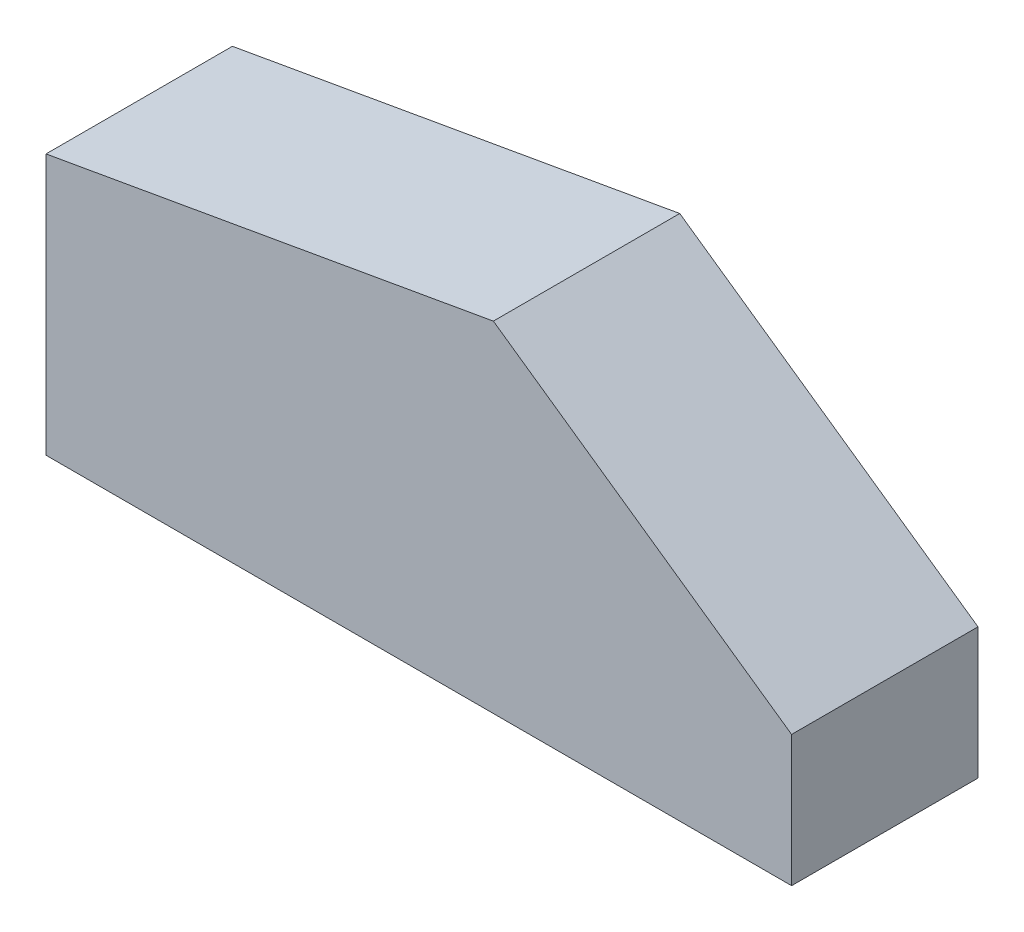
ISO-10303-21;
HEADER;
FILE_DESCRIPTION(('STEP AP214'),'2;1');
FILE_NAME('part.step','',(''),(''),'','','');
FILE_SCHEMA(('AUTOMOTIVE_DESIGN { 1 0 10303 214 1 1 1 1 }'));
ENDSEC;
DATA;
#1=APPLICATION_CONTEXT('core data for automotive mechanical design processes');
#2=APPLICATION_PROTOCOL_DEFINITION('international standard','automotive_design',2000,#1);
#3=PRODUCT_CONTEXT('',#1,'mechanical');
#4=PRODUCT('Part','Part','',(#3));
#5=PRODUCT_RELATED_PRODUCT_CATEGORY('part','',(#4));
#6=PRODUCT_DEFINITION_FORMATION('','',#4);
#7=PRODUCT_DEFINITION_CONTEXT('part definition',#1,'design');
#8=PRODUCT_DEFINITION('design','',#6,#7);
#9=PRODUCT_DEFINITION_SHAPE('','',#8);
#10=(LENGTH_UNIT() NAMED_UNIT(*) SI_UNIT(.MILLI.,.METRE.));
#11=(NAMED_UNIT(*) PLANE_ANGLE_UNIT() SI_UNIT($,.RADIAN.));
#12=(NAMED_UNIT(*) SI_UNIT($,.STERADIAN.) SOLID_ANGLE_UNIT());
#13=UNCERTAINTY_MEASURE_WITH_UNIT(LENGTH_MEASURE(1.E-05),#10,'distance_accuracy_value','');
#14=(GEOMETRIC_REPRESENTATION_CONTEXT(3) GLOBAL_UNCERTAINTY_ASSIGNED_CONTEXT((#13)) GLOBAL_UNIT_ASSIGNED_CONTEXT((#10,
#11,#12)) REPRESENTATION_CONTEXT('',''));
#15=CARTESIAN_POINT('',(0.,0.,0.));
#16=DIRECTION('',(0.,0.,1.));
#17=DIRECTION('',(1.,0.,0.));
#18=AXIS2_PLACEMENT_3D('',#15,#16,#17);
#19=CARTESIAN_POINT('',(0.,35.,25.));
#20=DIRECTION('',(1.,0.,0.));
#21=DIRECTION('',(0.,1.,0.));
#22=AXIS2_PLACEMENT_3D('',#19,#20,#21);
#23=PLANE('',#22);
#24=DIRECTION('',(0.,-1.,0.));
#25=VECTOR('',#24,1.);
#26=CARTESIAN_POINT('',(0.,35.,0.));
#27=LINE('',#26,#25);
#28=CARTESIAN_POINT('',(0.,35.,0.));
#29=VERTEX_POINT('',#28);
#30=CARTESIAN_POINT('',(0.,0.,0.));
#31=VERTEX_POINT('',#30);
#32=EDGE_CURVE('E107',#29,#31,#27,.T.);
#33=ORIENTED_EDGE('',*,*,#32,.T.);
#34=DIRECTION('',(0.,0.,-1.));
#35=VECTOR('',#34,1.);
#36=CARTESIAN_POINT('',(0.,0.,25.));
#37=LINE('',#36,#35);
#38=CARTESIAN_POINT('',(0.,0.,25.));
#39=VERTEX_POINT('',#38);
#40=EDGE_CURVE('E11',#39,#31,#37,.T.);
#41=ORIENTED_EDGE('',*,*,#40,.F.);
#42=DIRECTION('',(0.,-1.,0.));
#43=VECTOR('',#42,1.);
#44=CARTESIAN_POINT('',(0.,35.,25.));
#45=LINE('',#44,#43);
#46=CARTESIAN_POINT('',(0.,35.,25.));
#47=VERTEX_POINT('',#46);
#48=EDGE_CURVE('E115',#47,#39,#45,.T.);
#49=ORIENTED_EDGE('',*,*,#48,.F.);
#50=DIRECTION('',(0.,0.,-1.));
#51=VECTOR('',#50,1.);
#52=CARTESIAN_POINT('',(0.,35.,25.));
#53=LINE('',#52,#51);
#54=EDGE_CURVE('E103',#47,#29,#53,.T.);
#55=ORIENTED_EDGE('',*,*,#54,.T.);
#56=EDGE_LOOP('',(#33,#41,#49,#55));
#57=FACE_BOUND('',#56,.T.);
#58=ADVANCED_FACE('F33',(#57),#23,.F.);
#59=CARTESIAN_POINT('',(0.,0.,25.));
#60=DIRECTION('',(0.,1.,0.));
#61=DIRECTION('',(0.,0.,1.));
#62=AXIS2_PLACEMENT_3D('',#59,#60,#61);
#63=PLANE('',#62);
#64=DIRECTION('',(1.,0.,0.));
#65=VECTOR('',#64,1.);
#66=CARTESIAN_POINT('',(0.,0.,0.));
#67=LINE('',#66,#65);
#68=CARTESIAN_POINT('',(100.,0.,0.));
#69=VERTEX_POINT('',#68);
#70=EDGE_CURVE('E110',#31,#69,#67,.T.);
#71=ORIENTED_EDGE('',*,*,#70,.T.);
#72=DIRECTION('',(0.,0.,-1.));
#73=VECTOR('',#72,1.);
#74=CARTESIAN_POINT('',(100.,0.,25.));
#75=LINE('',#74,#73);
#76=CARTESIAN_POINT('',(100.,0.,25.));
#77=VERTEX_POINT('',#76);
#78=EDGE_CURVE('E41',#77,#69,#75,.T.);
#79=ORIENTED_EDGE('',*,*,#78,.F.);
#80=DIRECTION('',(1.,0.,0.));
#81=VECTOR('',#80,1.);
#82=CARTESIAN_POINT('',(0.,0.,25.));
#83=LINE('',#82,#81);
#84=EDGE_CURVE('E83',#39,#77,#83,.T.);
#85=ORIENTED_EDGE('',*,*,#84,.F.);
#86=ORIENTED_EDGE('',*,*,#40,.T.);
#87=EDGE_LOOP('',(#71,#79,#85,#86));
#88=FACE_BOUND('',#87,.T.);
#89=ADVANCED_FACE('F134',(#88),#63,.F.);
#90=CARTESIAN_POINT('',(100.,0.,25.));
#91=DIRECTION('',(-1.,0.,0.));
#92=DIRECTION('',(0.,0.,1.));
#93=AXIS2_PLACEMENT_3D('',#90,#91,#92);
#94=PLANE('',#93);
#95=DIRECTION('',(0.,1.,0.));
#96=VECTOR('',#95,1.);
#97=CARTESIAN_POINT('',(100.,0.,0.));
#98=LINE('',#97,#96);
#99=CARTESIAN_POINT('',(100.,17.571317314119,0.));
#100=VERTEX_POINT('',#99);
#101=EDGE_CURVE('E98',#69,#100,#98,.T.);
#102=ORIENTED_EDGE('',*,*,#101,.T.);
#103=DIRECTION('',(0.,0.,-1.));
#104=VECTOR('',#103,1.);
#105=CARTESIAN_POINT('',(100.,17.571317314119,25.));
#106=LINE('',#105,#104);
#107=CARTESIAN_POINT('',(100.,17.571317314119,25.));
#108=VERTEX_POINT('',#107);
#109=EDGE_CURVE('E95',#108,#100,#106,.T.);
#110=ORIENTED_EDGE('',*,*,#109,.F.);
#111=DIRECTION('',(0.,1.,0.));
#112=VECTOR('',#111,1.);
#113=CARTESIAN_POINT('',(100.,0.,25.));
#114=LINE('',#113,#112);
#115=EDGE_CURVE('E87',#77,#108,#114,.T.);
#116=ORIENTED_EDGE('',*,*,#115,.F.);
#117=ORIENTED_EDGE('',*,*,#78,.T.);
#118=EDGE_LOOP('',(#102,#110,#116,#117));
#119=FACE_BOUND('',#118,.T.);
#120=ADVANCED_FACE('F96',(#119),#94,.F.);
#121=CARTESIAN_POINT('',(100.,17.571317314119,25.));
#122=DIRECTION('',(-0.57357643635105,-0.819152044288989,0.));
#123=DIRECTION('',(0.819152044288989,-0.57357643635105,0.));
#124=AXIS2_PLACEMENT_3D('',#121,#122,#123);
#125=PLANE('',#124);
#126=DIRECTION('',(-0.819152044288989,0.57357643635105,0.));
#127=VECTOR('',#126,1.);
#128=CARTESIAN_POINT('',(100.,17.571317314119,0.));
#129=LINE('',#128,#127);
#130=CARTESIAN_POINT('',(60.,45.5796188425077,0.));
#131=VERTEX_POINT('',#130);
#132=EDGE_CURVE('E69',#100,#131,#129,.T.);
#133=ORIENTED_EDGE('',*,*,#132,.T.);
#134=DIRECTION('',(0.,0.,-1.));
#135=VECTOR('',#134,1.);
#136=CARTESIAN_POINT('',(60.,45.5796188425077,25.));
#137=LINE('',#136,#135);
#138=CARTESIAN_POINT('',(60.,45.5796188425077,25.));
#139=VERTEX_POINT('',#138);
#140=EDGE_CURVE('E99',#139,#131,#137,.T.);
#141=ORIENTED_EDGE('',*,*,#140,.F.);
#142=DIRECTION('',(-0.819152044288989,0.57357643635105,0.));
#143=VECTOR('',#142,1.);
#144=CARTESIAN_POINT('',(100.,17.571317314119,25.));
#145=LINE('',#144,#143);
#146=EDGE_CURVE('E91',#108,#139,#145,.T.);
#147=ORIENTED_EDGE('',*,*,#146,.F.);
#148=ORIENTED_EDGE('',*,*,#109,.T.);
#149=EDGE_LOOP('',(#133,#141,#147,#148));
#150=FACE_BOUND('',#149,.T.);
#151=ADVANCED_FACE('F101',(#150),#125,.F.);
#152=CARTESIAN_POINT('',(60.,45.5796188425077,25.));
#153=DIRECTION('',(0.173648177666927,-0.984807753012209,0.));
#154=DIRECTION('',(0.984807753012209,0.173648177666927,0.));
#155=AXIS2_PLACEMENT_3D('',#152,#153,#154);
#156=PLANE('',#155);
#157=DIRECTION('',(-0.984807753012209,-0.173648177666927,0.));
#158=VECTOR('',#157,1.);
#159=CARTESIAN_POINT('',(60.,45.5796188425077,0.));
#160=LINE('',#159,#158);
#161=EDGE_CURVE('E75',#131,#29,#160,.T.);
#162=ORIENTED_EDGE('',*,*,#161,.T.);
#163=ORIENTED_EDGE('',*,*,#54,.F.);
#164=DIRECTION('',(-0.984807753012209,-0.173648177666927,0.));
#165=VECTOR('',#164,1.);
#166=CARTESIAN_POINT('',(60.,45.5796188425077,25.));
#167=LINE('',#166,#165);
#168=EDGE_CURVE('E49',#139,#47,#167,.T.);
#169=ORIENTED_EDGE('',*,*,#168,.F.);
#170=ORIENTED_EDGE('',*,*,#140,.T.);
#171=EDGE_LOOP('',(#162,#163,#169,#170));
#172=FACE_BOUND('',#171,.T.);
#173=ADVANCED_FACE('F123',(#172),#156,.F.);
#174=CARTESIAN_POINT('',(0.,0.,25.));
#175=DIRECTION('',(0.,0.,1.));
#176=DIRECTION('',(1.,0.,0.));
#177=AXIS2_PLACEMENT_3D('',#174,#175,#176);
#178=PLANE('',#177);
#179=ORIENTED_EDGE('',*,*,#48,.T.);
#180=ORIENTED_EDGE('',*,*,#84,.T.);
#181=ORIENTED_EDGE('',*,*,#115,.T.);
#182=ORIENTED_EDGE('',*,*,#146,.T.);
#183=ORIENTED_EDGE('',*,*,#168,.T.);
#184=EDGE_LOOP('',(#179,#180,#181,#182,#183));
#185=FACE_BOUND('',#184,.T.);
#186=ADVANCED_FACE('F89',(#185),#178,.T.);
#187=CARTESIAN_POINT('',(0.,0.,0.));
#188=DIRECTION('',(0.,0.,1.));
#189=DIRECTION('',(1.,0.,0.));
#190=AXIS2_PLACEMENT_3D('',#187,#188,#189);
#191=PLANE('',#190);
#192=ORIENTED_EDGE('',*,*,#32,.F.);
#193=ORIENTED_EDGE('',*,*,#161,.F.);
#194=ORIENTED_EDGE('',*,*,#132,.F.);
#195=ORIENTED_EDGE('',*,*,#101,.F.);
#196=ORIENTED_EDGE('',*,*,#70,.F.);
#197=EDGE_LOOP('',(#192,#193,#194,#195,#196));
#198=FACE_BOUND('',#197,.T.);
#199=ADVANCED_FACE('F119',(#198),#191,.F.);
#200=CLOSED_SHELL('',(#58,#89,#120,#151,#173,#186,#199));
#201=MANIFOLD_SOLID_BREP('B2',#200);
#202=ADVANCED_BREP_SHAPE_REPRESENTATION('',(#18,#201),#14);
#203=SHAPE_DEFINITION_REPRESENTATION(#9,#202);
ENDSEC;
END-ISO-10303-21;
